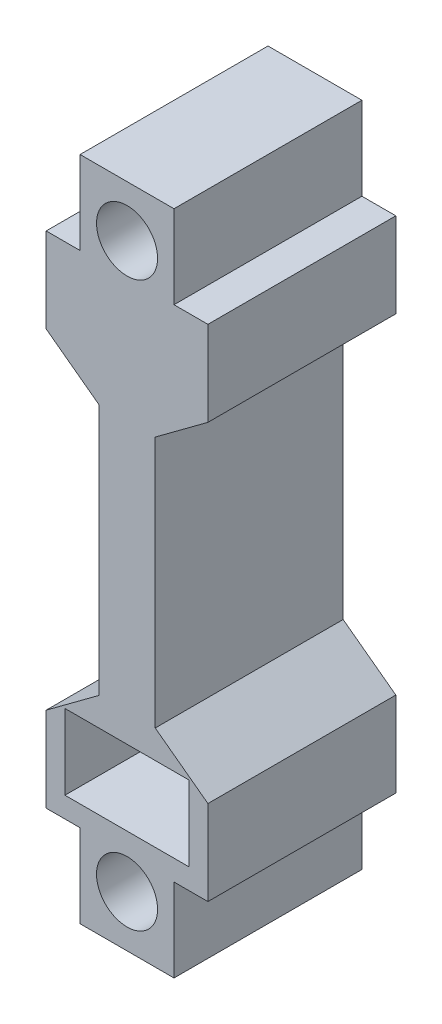
ISO-10303-21;
HEADER;
FILE_DESCRIPTION(('STEP AP214'),'2;1');
FILE_NAME('part.step','',(''),(''),'','','');
FILE_SCHEMA(('AUTOMOTIVE_DESIGN { 1 0 10303 214 1 1 1 1 }'));
ENDSEC;
DATA;
#1=APPLICATION_CONTEXT('core data for automotive mechanical design processes');
#2=APPLICATION_PROTOCOL_DEFINITION('international standard','automotive_design',2000,#1);
#3=PRODUCT_CONTEXT('',#1,'mechanical');
#4=PRODUCT('Part','Part','',(#3));
#5=PRODUCT_RELATED_PRODUCT_CATEGORY('part','',(#4));
#6=PRODUCT_DEFINITION_FORMATION('','',#4);
#7=PRODUCT_DEFINITION_CONTEXT('part definition',#1,'design');
#8=PRODUCT_DEFINITION('design','',#6,#7);
#9=PRODUCT_DEFINITION_SHAPE('','',#8);
#10=(LENGTH_UNIT() NAMED_UNIT(*) SI_UNIT(.MILLI.,.METRE.));
#11=(NAMED_UNIT(*) PLANE_ANGLE_UNIT() SI_UNIT($,.RADIAN.));
#12=(NAMED_UNIT(*) SI_UNIT($,.STERADIAN.) SOLID_ANGLE_UNIT());
#13=UNCERTAINTY_MEASURE_WITH_UNIT(LENGTH_MEASURE(1.E-05),#10,'distance_accuracy_value','');
#14=(GEOMETRIC_REPRESENTATION_CONTEXT(3) GLOBAL_UNCERTAINTY_ASSIGNED_CONTEXT((#13)) GLOBAL_UNIT_ASSIGNED_CONTEXT((#10,
#11,#12)) REPRESENTATION_CONTEXT('',''));
#15=CARTESIAN_POINT('',(0.,0.,0.));
#16=DIRECTION('',(0.,0.,1.));
#17=DIRECTION('',(1.,0.,0.));
#18=AXIS2_PLACEMENT_3D('',#15,#16,#17);
#19=CARTESIAN_POINT('',(0.,0.,20.));
#20=DIRECTION('',(0.,0.,1.));
#21=DIRECTION('',(1.,0.,0.));
#22=AXIS2_PLACEMENT_3D('',#19,#20,#21);
#23=PLANE('',#22);
#24=DIRECTION('',(0.,1.,0.));
#25=VECTOR('',#24,1.);
#26=CARTESIAN_POINT('',(6.60709454060174,-24.4083763532883,20.));
#27=LINE('',#26,#25);
#28=CARTESIAN_POINT('',(6.60709454060174,-24.4083763532883,20.));
#29=VERTEX_POINT('',#28);
#30=CARTESIAN_POINT('',(6.60709454060174,-16.4083763532883,20.));
#31=VERTEX_POINT('',#30);
#32=EDGE_CURVE('E210',#29,#31,#27,.T.);
#33=ORIENTED_EDGE('',*,*,#32,.F.);
#34=DIRECTION('',(1.,0.,0.));
#35=VECTOR('',#34,1.);
#36=CARTESIAN_POINT('',(6.60709454060174,-24.4083763532883,20.));
#37=LINE('',#36,#35);
#38=CARTESIAN_POINT('',(-6.60709454060174,-24.4083763532883,20.));
#39=VERTEX_POINT('',#38);
#40=EDGE_CURVE('E201',#39,#29,#37,.T.);
#41=ORIENTED_EDGE('',*,*,#40,.F.);
#42=DIRECTION('',(0.,-1.,0.));
#43=VECTOR('',#42,1.);
#44=CARTESIAN_POINT('',(-6.60709454060174,-24.4083763532883,20.));
#45=LINE('',#44,#43);
#46=CARTESIAN_POINT('',(-6.60709454060174,-16.4083763532883,20.));
#47=VERTEX_POINT('',#46);
#48=EDGE_CURVE('E228',#47,#39,#45,.T.);
#49=ORIENTED_EDGE('',*,*,#48,.F.);
#50=DIRECTION('',(-1.,0.,0.));
#51=VECTOR('',#50,1.);
#52=CARTESIAN_POINT('',(-6.60709454060174,-16.4083763532883,20.));
#53=LINE('',#52,#51);
#54=EDGE_CURVE('E224',#31,#47,#53,.T.);
#55=ORIENTED_EDGE('',*,*,#54,.F.);
#56=EDGE_LOOP('',(#33,#41,#49,#55));
#57=FACE_BOUND('',#56,.T.);
#58=CARTESIAN_POINT('',(0.,30.,20.));
#59=DIRECTION('',(0.,0.,1.));
#60=DIRECTION('',(1.,0.,0.));
#61=AXIS2_PLACEMENT_3D('',#58,#59,#60);
#62=CIRCLE('',#61,3.25);
#63=CARTESIAN_POINT('',(3.25,30.,20.));
#64=VERTEX_POINT('',#63);
#65=EDGE_CURVE('E252',#64,#64,#62,.T.);
#66=ORIENTED_EDGE('',*,*,#65,.F.);
#67=EDGE_LOOP('',(#66));
#68=FACE_BOUND('',#67,.T.);
#69=DIRECTION('',(0.803198893234773,-0.595710951642183,0.));
#70=VECTOR('',#69,1.);
#71=CARTESIAN_POINT('',(-8.60709454060174,17.5670071144406,20.));
#72=LINE('',#71,#70);
#73=CARTESIAN_POINT('',(-8.60709454060174,17.5670071144406,20.));
#74=VERTEX_POINT('',#73);
#75=CARTESIAN_POINT('',(-3.,13.4083763532883,20.));
#76=VERTEX_POINT('',#75);
#77=EDGE_CURVE('E260',#74,#76,#72,.T.);
#78=ORIENTED_EDGE('',*,*,#77,.T.);
#79=DIRECTION('',(0.,-1.,0.));
#80=VECTOR('',#79,1.);
#81=CARTESIAN_POINT('',(-3.,13.4083763532883,20.));
#82=LINE('',#81,#80);
#83=CARTESIAN_POINT('',(-2.99999999999999,-13.4083763532883,20.));
#84=VERTEX_POINT('',#83);
#85=EDGE_CURVE('E264',#76,#84,#82,.T.);
#86=ORIENTED_EDGE('',*,*,#85,.T.);
#87=DIRECTION('',(-0.803198893234772,-0.595710951642184,0.));
#88=VECTOR('',#87,1.);
#89=CARTESIAN_POINT('',(-8.60709454060174,-17.5670071144406,20.));
#90=LINE('',#89,#88);
#91=CARTESIAN_POINT('',(-8.60709454060174,-17.5670071144406,20.));
#92=VERTEX_POINT('',#91);
#93=EDGE_CURVE('E268',#84,#92,#90,.T.);
#94=ORIENTED_EDGE('',*,*,#93,.T.);
#95=DIRECTION('',(0.,-1.,0.));
#96=VECTOR('',#95,1.);
#97=CARTESIAN_POINT('',(-8.60709454060173,-26.6027849304811,20.));
#98=LINE('',#97,#96);
#99=CARTESIAN_POINT('',(-8.60709454060173,-26.6027849304811,20.));
#100=VERTEX_POINT('',#99);
#101=EDGE_CURVE('E271',#92,#100,#98,.T.);
#102=ORIENTED_EDGE('',*,*,#101,.T.);
#103=DIRECTION('',(1.,0.,0.));
#104=VECTOR('',#103,1.);
#105=CARTESIAN_POINT('',(-8.60709454060173,-26.6027849304811,20.));
#106=LINE('',#105,#104);
#107=CARTESIAN_POINT('',(-4.9980986518052,-26.6027849304811,20.));
#108=VERTEX_POINT('',#107);
#109=EDGE_CURVE('E274',#100,#108,#106,.T.);
#110=ORIENTED_EDGE('',*,*,#109,.T.);
#111=DIRECTION('',(0.,-1.,0.));
#112=VECTOR('',#111,1.);
#113=CARTESIAN_POINT('',(-4.9980986518052,-26.6027849304811,20.));
#114=LINE('',#113,#112);
#115=CARTESIAN_POINT('',(-4.9980986518052,-35.4520375162647,20.));
#116=VERTEX_POINT('',#115);
#117=EDGE_CURVE('E277',#108,#116,#114,.T.);
#118=ORIENTED_EDGE('',*,*,#117,.T.);
#119=DIRECTION('',(1.,0.,0.));
#120=VECTOR('',#119,1.);
#121=CARTESIAN_POINT('',(-4.9980986518052,-35.4520375162647,20.));
#122=LINE('',#121,#120);
#123=CARTESIAN_POINT('',(4.99809865180521,-35.4520375162647,20.));
#124=VERTEX_POINT('',#123);
#125=EDGE_CURVE('E280',#116,#124,#122,.T.);
#126=ORIENTED_EDGE('',*,*,#125,.T.);
#127=DIRECTION('',(0.,1.,0.));
#128=VECTOR('',#127,1.);
#129=CARTESIAN_POINT('',(4.99809865180522,-26.6027849304811,20.));
#130=LINE('',#129,#128);
#131=CARTESIAN_POINT('',(4.99809865180522,-26.6027849304811,20.));
#132=VERTEX_POINT('',#131);
#133=EDGE_CURVE('E283',#124,#132,#130,.T.);
#134=ORIENTED_EDGE('',*,*,#133,.T.);
#135=DIRECTION('',(1.,0.,0.));
#136=VECTOR('',#135,1.);
#137=CARTESIAN_POINT('',(8.60709454060175,-26.6027849304811,20.));
#138=LINE('',#137,#136);
#139=CARTESIAN_POINT('',(8.60709454060175,-26.6027849304811,20.));
#140=VERTEX_POINT('',#139);
#141=EDGE_CURVE('E286',#132,#140,#138,.T.);
#142=ORIENTED_EDGE('',*,*,#141,.T.);
#143=DIRECTION('',(0.,1.,0.));
#144=VECTOR('',#143,1.);
#145=CARTESIAN_POINT('',(8.60709454060175,-26.6027849304811,20.));
#146=LINE('',#145,#144);
#147=CARTESIAN_POINT('',(8.60709454060175,-17.5670071144406,20.));
#148=VERTEX_POINT('',#147);
#149=EDGE_CURVE('E289',#140,#148,#146,.T.);
#150=ORIENTED_EDGE('',*,*,#149,.T.);
#151=DIRECTION('',(-0.803198893234773,0.595710951642184,0.));
#152=VECTOR('',#151,1.);
#153=CARTESIAN_POINT('',(8.60709454060175,-17.5670071144406,20.));
#154=LINE('',#153,#152);
#155=CARTESIAN_POINT('',(3.00000000000001,-13.4083763532883,20.));
#156=VERTEX_POINT('',#155);
#157=EDGE_CURVE('E292',#148,#156,#154,.T.);
#158=ORIENTED_EDGE('',*,*,#157,.T.);
#159=DIRECTION('',(0.,1.,0.));
#160=VECTOR('',#159,1.);
#161=CARTESIAN_POINT('',(3.00000000000001,13.4083763532883,20.));
#162=LINE('',#161,#160);
#163=CARTESIAN_POINT('',(3.00000000000001,13.4083763532883,20.));
#164=VERTEX_POINT('',#163);
#165=EDGE_CURVE('E295',#156,#164,#162,.T.);
#166=ORIENTED_EDGE('',*,*,#165,.T.);
#167=DIRECTION('',(0.803198893234773,0.595710951642184,0.));
#168=VECTOR('',#167,1.);
#169=CARTESIAN_POINT('',(8.60709454060175,17.5670071144406,20.));
#170=LINE('',#169,#168);
#171=CARTESIAN_POINT('',(8.60709454060175,17.5670071144406,20.));
#172=VERTEX_POINT('',#171);
#173=EDGE_CURVE('E298',#164,#172,#170,.T.);
#174=ORIENTED_EDGE('',*,*,#173,.T.);
#175=DIRECTION('',(0.,1.,0.));
#176=VECTOR('',#175,1.);
#177=CARTESIAN_POINT('',(8.60709454060175,26.6027849304811,20.));
#178=LINE('',#177,#176);
#179=CARTESIAN_POINT('',(8.60709454060175,26.6027849304811,20.));
#180=VERTEX_POINT('',#179);
#181=EDGE_CURVE('E301',#172,#180,#178,.T.);
#182=ORIENTED_EDGE('',*,*,#181,.T.);
#183=DIRECTION('',(-1.,0.,0.));
#184=VECTOR('',#183,1.);
#185=CARTESIAN_POINT('',(8.60709454060175,26.6027849304811,20.));
#186=LINE('',#185,#184);
#187=CARTESIAN_POINT('',(4.99809865180522,26.6027849304811,20.));
#188=VERTEX_POINT('',#187);
#189=EDGE_CURVE('E304',#180,#188,#186,.T.);
#190=ORIENTED_EDGE('',*,*,#189,.T.);
#191=DIRECTION('',(0.,1.,0.));
#192=VECTOR('',#191,1.);
#193=CARTESIAN_POINT('',(4.99809865180522,26.6027849304811,20.));
#194=LINE('',#193,#192);
#195=CARTESIAN_POINT('',(4.99809865180521,35.4520375162647,20.));
#196=VERTEX_POINT('',#195);
#197=EDGE_CURVE('E307',#188,#196,#194,.T.);
#198=ORIENTED_EDGE('',*,*,#197,.T.);
#199=DIRECTION('',(-1.,0.,0.));
#200=VECTOR('',#199,1.);
#201=CARTESIAN_POINT('',(-4.99809865180521,35.4520375162647,20.));
#202=LINE('',#201,#200);
#203=CARTESIAN_POINT('',(-4.99809865180521,35.4520375162647,20.));
#204=VERTEX_POINT('',#203);
#205=EDGE_CURVE('E310',#196,#204,#202,.T.);
#206=ORIENTED_EDGE('',*,*,#205,.T.);
#207=DIRECTION('',(0.,-1.,0.));
#208=VECTOR('',#207,1.);
#209=CARTESIAN_POINT('',(-4.99809865180521,26.6027849304811,20.));
#210=LINE('',#209,#208);
#211=CARTESIAN_POINT('',(-4.99809865180521,26.6027849304811,20.));
#212=VERTEX_POINT('',#211);
#213=EDGE_CURVE('E313',#204,#212,#210,.T.);
#214=ORIENTED_EDGE('',*,*,#213,.T.);
#215=DIRECTION('',(-1.,0.,0.));
#216=VECTOR('',#215,1.);
#217=CARTESIAN_POINT('',(-8.60709454060174,26.6027849304811,20.));
#218=LINE('',#217,#216);
#219=CARTESIAN_POINT('',(-8.60709454060174,26.6027849304811,20.));
#220=VERTEX_POINT('',#219);
#221=EDGE_CURVE('E316',#212,#220,#218,.T.);
#222=ORIENTED_EDGE('',*,*,#221,.T.);
#223=DIRECTION('',(0.,-1.,0.));
#224=VECTOR('',#223,1.);
#225=CARTESIAN_POINT('',(-8.60709454060174,26.6027849304811,20.));
#226=LINE('',#225,#224);
#227=EDGE_CURVE('E319',#220,#74,#226,.T.);
#228=ORIENTED_EDGE('',*,*,#227,.T.);
#229=EDGE_LOOP('',(#78,#86,#94,#102,#110,#118,#126,#134,#142,#150,#158,#166,#174,#182,#190,#198,
#206,#214,#222,#228));
#230=FACE_BOUND('',#229,.T.);
#231=CARTESIAN_POINT('',(0.,-30.,20.));
#232=DIRECTION('',(0.,0.,1.));
#233=DIRECTION('',(-1.,0.,0.));
#234=AXIS2_PLACEMENT_3D('',#231,#232,#233);
#235=CIRCLE('',#234,3.25);
#236=CARTESIAN_POINT('',(-3.25,-30.,20.));
#237=VERTEX_POINT('',#236);
#238=EDGE_CURVE('E236',#237,#237,#235,.T.);
#239=ORIENTED_EDGE('',*,*,#238,.F.);
#240=EDGE_LOOP('',(#239));
#241=FACE_BOUND('',#240,.T.);
#242=ADVANCED_FACE('F39',(#57,#68,#230,#241),#23,.T.);
#243=CARTESIAN_POINT('',(0.,0.,0.));
#244=DIRECTION('',(0.,0.,1.));
#245=DIRECTION('',(1.,0.,0.));
#246=AXIS2_PLACEMENT_3D('',#243,#244,#245);
#247=PLANE('',#246);
#248=CARTESIAN_POINT('',(0.,30.,0.));
#249=DIRECTION('',(0.,0.,1.));
#250=DIRECTION('',(1.,0.,0.));
#251=AXIS2_PLACEMENT_3D('',#248,#249,#250);
#252=CIRCLE('',#251,3.25);
#253=CARTESIAN_POINT('',(3.25,30.,0.));
#254=VERTEX_POINT('',#253);
#255=EDGE_CURVE('E219',#254,#254,#252,.T.);
#256=ORIENTED_EDGE('',*,*,#255,.T.);
#257=EDGE_LOOP('',(#256));
#258=FACE_BOUND('',#257,.T.);
#259=DIRECTION('',(0.803198893234773,-0.595710951642183,0.));
#260=VECTOR('',#259,1.);
#261=CARTESIAN_POINT('',(-8.60709454060174,17.5670071144406,0.));
#262=LINE('',#261,#260);
#263=CARTESIAN_POINT('',(-8.60709454060174,17.5670071144406,0.));
#264=VERTEX_POINT('',#263);
#265=CARTESIAN_POINT('',(-3.,13.4083763532883,0.));
#266=VERTEX_POINT('',#265);
#267=EDGE_CURVE('E256',#264,#266,#262,.T.);
#268=ORIENTED_EDGE('',*,*,#267,.F.);
#269=DIRECTION('',(0.,-1.,0.));
#270=VECTOR('',#269,1.);
#271=CARTESIAN_POINT('',(-8.60709454060174,26.6027849304811,0.));
#272=LINE('',#271,#270);
#273=CARTESIAN_POINT('',(-8.60709454060174,26.6027849304811,0.));
#274=VERTEX_POINT('',#273);
#275=EDGE_CURVE('E265',#274,#264,#272,.T.);
#276=ORIENTED_EDGE('',*,*,#275,.F.);
#277=DIRECTION('',(-1.,0.,0.));
#278=VECTOR('',#277,1.);
#279=CARTESIAN_POINT('',(-8.60709454060174,26.6027849304811,0.));
#280=LINE('',#279,#278);
#281=CARTESIAN_POINT('',(-4.99809865180521,26.6027849304811,0.));
#282=VERTEX_POINT('',#281);
#283=EDGE_CURVE('E377',#282,#274,#280,.T.);
#284=ORIENTED_EDGE('',*,*,#283,.F.);
#285=DIRECTION('',(0.,-1.,0.));
#286=VECTOR('',#285,1.);
#287=CARTESIAN_POINT('',(-4.99809865180521,26.6027849304811,0.));
#288=LINE('',#287,#286);
#289=CARTESIAN_POINT('',(-4.99809865180521,35.4520375162647,0.));
#290=VERTEX_POINT('',#289);
#291=EDGE_CURVE('E374',#290,#282,#288,.T.);
#292=ORIENTED_EDGE('',*,*,#291,.F.);
#293=DIRECTION('',(-1.,0.,0.));
#294=VECTOR('',#293,1.);
#295=CARTESIAN_POINT('',(-4.99809865180521,35.4520375162647,0.));
#296=LINE('',#295,#294);
#297=CARTESIAN_POINT('',(4.99809865180521,35.4520375162647,0.));
#298=VERTEX_POINT('',#297);
#299=EDGE_CURVE('E371',#298,#290,#296,.T.);
#300=ORIENTED_EDGE('',*,*,#299,.F.);
#301=DIRECTION('',(0.,1.,0.));
#302=VECTOR('',#301,1.);
#303=CARTESIAN_POINT('',(4.99809865180522,26.6027849304811,0.));
#304=LINE('',#303,#302);
#305=CARTESIAN_POINT('',(4.99809865180522,26.6027849304811,0.));
#306=VERTEX_POINT('',#305);
#307=EDGE_CURVE('E368',#306,#298,#304,.T.);
#308=ORIENTED_EDGE('',*,*,#307,.F.);
#309=DIRECTION('',(-1.,0.,0.));
#310=VECTOR('',#309,1.);
#311=CARTESIAN_POINT('',(8.60709454060175,26.6027849304811,0.));
#312=LINE('',#311,#310);
#313=CARTESIAN_POINT('',(8.60709454060175,26.6027849304811,0.));
#314=VERTEX_POINT('',#313);
#315=EDGE_CURVE('E365',#314,#306,#312,.T.);
#316=ORIENTED_EDGE('',*,*,#315,.F.);
#317=DIRECTION('',(0.,1.,0.));
#318=VECTOR('',#317,1.);
#319=CARTESIAN_POINT('',(8.60709454060175,26.6027849304811,0.));
#320=LINE('',#319,#318);
#321=CARTESIAN_POINT('',(8.60709454060175,17.5670071144406,0.));
#322=VERTEX_POINT('',#321);
#323=EDGE_CURVE('E362',#322,#314,#320,.T.);
#324=ORIENTED_EDGE('',*,*,#323,.F.);
#325=DIRECTION('',(0.803198893234773,0.595710951642184,0.));
#326=VECTOR('',#325,1.);
#327=CARTESIAN_POINT('',(8.60709454060175,17.5670071144406,0.));
#328=LINE('',#327,#326);
#329=CARTESIAN_POINT('',(3.00000000000001,13.4083763532883,0.));
#330=VERTEX_POINT('',#329);
#331=EDGE_CURVE('E359',#330,#322,#328,.T.);
#332=ORIENTED_EDGE('',*,*,#331,.F.);
#333=DIRECTION('',(0.,1.,0.));
#334=VECTOR('',#333,1.);
#335=CARTESIAN_POINT('',(3.00000000000001,13.4083763532883,0.));
#336=LINE('',#335,#334);
#337=CARTESIAN_POINT('',(3.00000000000001,-13.4083763532883,0.));
#338=VERTEX_POINT('',#337);
#339=EDGE_CURVE('E356',#338,#330,#336,.T.);
#340=ORIENTED_EDGE('',*,*,#339,.F.);
#341=DIRECTION('',(-0.803198893234773,0.595710951642184,0.));
#342=VECTOR('',#341,1.);
#343=CARTESIAN_POINT('',(8.60709454060175,-17.5670071144406,0.));
#344=LINE('',#343,#342);
#345=CARTESIAN_POINT('',(8.60709454060175,-17.5670071144406,0.));
#346=VERTEX_POINT('',#345);
#347=EDGE_CURVE('E353',#346,#338,#344,.T.);
#348=ORIENTED_EDGE('',*,*,#347,.F.);
#349=DIRECTION('',(0.,1.,0.));
#350=VECTOR('',#349,1.);
#351=CARTESIAN_POINT('',(8.60709454060175,-26.6027849304811,0.));
#352=LINE('',#351,#350);
#353=CARTESIAN_POINT('',(8.60709454060175,-26.6027849304811,0.));
#354=VERTEX_POINT('',#353);
#355=EDGE_CURVE('E350',#354,#346,#352,.T.);
#356=ORIENTED_EDGE('',*,*,#355,.F.);
#357=DIRECTION('',(1.,0.,0.));
#358=VECTOR('',#357,1.);
#359=CARTESIAN_POINT('',(8.60709454060175,-26.6027849304811,0.));
#360=LINE('',#359,#358);
#361=CARTESIAN_POINT('',(4.99809865180522,-26.6027849304811,0.));
#362=VERTEX_POINT('',#361);
#363=EDGE_CURVE('E347',#362,#354,#360,.T.);
#364=ORIENTED_EDGE('',*,*,#363,.F.);
#365=DIRECTION('',(0.,1.,0.));
#366=VECTOR('',#365,1.);
#367=CARTESIAN_POINT('',(4.99809865180522,-26.6027849304811,0.));
#368=LINE('',#367,#366);
#369=CARTESIAN_POINT('',(4.99809865180521,-35.4520375162647,0.));
#370=VERTEX_POINT('',#369);
#371=EDGE_CURVE('E344',#370,#362,#368,.T.);
#372=ORIENTED_EDGE('',*,*,#371,.F.);
#373=DIRECTION('',(1.,0.,0.));
#374=VECTOR('',#373,1.);
#375=CARTESIAN_POINT('',(-4.9980986518052,-35.4520375162647,0.));
#376=LINE('',#375,#374);
#377=CARTESIAN_POINT('',(-4.9980986518052,-35.4520375162647,0.));
#378=VERTEX_POINT('',#377);
#379=EDGE_CURVE('E341',#378,#370,#376,.T.);
#380=ORIENTED_EDGE('',*,*,#379,.F.);
#381=DIRECTION('',(0.,-1.,0.));
#382=VECTOR('',#381,1.);
#383=CARTESIAN_POINT('',(-4.9980986518052,-26.6027849304811,0.));
#384=LINE('',#383,#382);
#385=CARTESIAN_POINT('',(-4.9980986518052,-26.6027849304811,0.));
#386=VERTEX_POINT('',#385);
#387=EDGE_CURVE('E338',#386,#378,#384,.T.);
#388=ORIENTED_EDGE('',*,*,#387,.F.);
#389=DIRECTION('',(1.,0.,0.));
#390=VECTOR('',#389,1.);
#391=CARTESIAN_POINT('',(-8.60709454060173,-26.6027849304811,0.));
#392=LINE('',#391,#390);
#393=CARTESIAN_POINT('',(-8.60709454060173,-26.6027849304811,0.));
#394=VERTEX_POINT('',#393);
#395=EDGE_CURVE('E335',#394,#386,#392,.T.);
#396=ORIENTED_EDGE('',*,*,#395,.F.);
#397=DIRECTION('',(0.,-1.,0.));
#398=VECTOR('',#397,1.);
#399=CARTESIAN_POINT('',(-8.60709454060173,-26.6027849304811,0.));
#400=LINE('',#399,#398);
#401=CARTESIAN_POINT('',(-8.60709454060174,-17.5670071144406,0.));
#402=VERTEX_POINT('',#401);
#403=EDGE_CURVE('E332',#402,#394,#400,.T.);
#404=ORIENTED_EDGE('',*,*,#403,.F.);
#405=DIRECTION('',(-0.803198893234772,-0.595710951642184,0.));
#406=VECTOR('',#405,1.);
#407=CARTESIAN_POINT('',(-8.60709454060174,-17.5670071144406,0.));
#408=LINE('',#407,#406);
#409=CARTESIAN_POINT('',(-2.99999999999999,-13.4083763532883,0.));
#410=VERTEX_POINT('',#409);
#411=EDGE_CURVE('E329',#410,#402,#408,.T.);
#412=ORIENTED_EDGE('',*,*,#411,.F.);
#413=DIRECTION('',(0.,-1.,0.));
#414=VECTOR('',#413,1.);
#415=CARTESIAN_POINT('',(-3.,13.4083763532883,0.));
#416=LINE('',#415,#414);
#417=EDGE_CURVE('E326',#266,#410,#416,.T.);
#418=ORIENTED_EDGE('',*,*,#417,.F.);
#419=EDGE_LOOP('',(#268,#276,#284,#292,#300,#308,#316,#324,#332,#340,#348,#356,#364,#372,#380,
#388,#396,#404,#412,#418));
#420=FACE_BOUND('',#419,.T.);
#421=DIRECTION('',(1.,0.,0.));
#422=VECTOR('',#421,1.);
#423=CARTESIAN_POINT('',(6.60709454060174,-24.4083763532883,0.));
#424=LINE('',#423,#422);
#425=CARTESIAN_POINT('',(-6.60709454060174,-24.4083763532883,0.));
#426=VERTEX_POINT('',#425);
#427=CARTESIAN_POINT('',(6.60709454060174,-24.4083763532883,0.));
#428=VERTEX_POINT('',#427);
#429=EDGE_CURVE('E63',#426,#428,#424,.T.);
#430=ORIENTED_EDGE('',*,*,#429,.T.);
#431=DIRECTION('',(0.,1.,0.));
#432=VECTOR('',#431,1.);
#433=CARTESIAN_POINT('',(6.60709454060174,-24.4083763532883,0.));
#434=LINE('',#433,#432);
#435=CARTESIAN_POINT('',(6.60709454060174,-16.4083763532883,0.));
#436=VERTEX_POINT('',#435);
#437=EDGE_CURVE('E217',#428,#436,#434,.T.);
#438=ORIENTED_EDGE('',*,*,#437,.T.);
#439=DIRECTION('',(-1.,0.,0.));
#440=VECTOR('',#439,1.);
#441=CARTESIAN_POINT('',(-6.60709454060174,-16.4083763532883,0.));
#442=LINE('',#441,#440);
#443=CARTESIAN_POINT('',(-6.60709454060174,-16.4083763532883,0.));
#444=VERTEX_POINT('',#443);
#445=EDGE_CURVE('E239',#436,#444,#442,.T.);
#446=ORIENTED_EDGE('',*,*,#445,.T.);
#447=DIRECTION('',(0.,-1.,0.));
#448=VECTOR('',#447,1.);
#449=CARTESIAN_POINT('',(-6.60709454060174,-24.4083763532883,0.));
#450=LINE('',#449,#448);
#451=EDGE_CURVE('E211',#444,#426,#450,.T.);
#452=ORIENTED_EDGE('',*,*,#451,.T.);
#453=EDGE_LOOP('',(#430,#438,#446,#452));
#454=FACE_BOUND('',#453,.T.);
#455=CARTESIAN_POINT('',(0.,-30.,0.));
#456=DIRECTION('',(0.,0.,1.));
#457=DIRECTION('',(-1.,0.,0.));
#458=AXIS2_PLACEMENT_3D('',#455,#456,#457);
#459=CIRCLE('',#458,3.25);
#460=CARTESIAN_POINT('',(-3.25,-30.,0.));
#461=VERTEX_POINT('',#460);
#462=EDGE_CURVE('E791',#461,#461,#459,.T.);
#463=ORIENTED_EDGE('',*,*,#462,.T.);
#464=EDGE_LOOP('',(#463));
#465=FACE_BOUND('',#464,.T.);
#466=ADVANCED_FACE('F464',(#258,#420,#454,#465),#247,.F.);
#467=CARTESIAN_POINT('',(-8.60709454060174,17.5670071144406,20.));
#468=DIRECTION('',(0.595710951642184,0.803198893234773,0.));
#469=DIRECTION('',(-0.803198893234773,0.595710951642184,0.));
#470=AXIS2_PLACEMENT_3D('',#467,#468,#469);
#471=PLANE('',#470);
#472=ORIENTED_EDGE('',*,*,#267,.T.);
#473=DIRECTION('',(0.,0.,-1.));
#474=VECTOR('',#473,1.);
#475=CARTESIAN_POINT('',(-3.,13.4083763532883,20.));
#476=LINE('',#475,#474);
#477=EDGE_CURVE('E11',#76,#266,#476,.T.);
#478=ORIENTED_EDGE('',*,*,#477,.F.);
#479=ORIENTED_EDGE('',*,*,#77,.F.);
#480=DIRECTION('',(0.,0.,-1.));
#481=VECTOR('',#480,1.);
#482=CARTESIAN_POINT('',(-8.60709454060174,17.5670071144406,20.));
#483=LINE('',#482,#481);
#484=EDGE_CURVE('E322',#74,#264,#483,.T.);
#485=ORIENTED_EDGE('',*,*,#484,.T.);
#486=EDGE_LOOP('',(#472,#478,#479,#485));
#487=FACE_BOUND('',#486,.T.);
#488=ADVANCED_FACE('F41',(#487),#471,.F.);
#489=CARTESIAN_POINT('',(-3.,13.4083763532883,20.));
#490=DIRECTION('',(1.,0.,0.));
#491=DIRECTION('',(0.,1.,0.));
#492=AXIS2_PLACEMENT_3D('',#489,#490,#491);
#493=PLANE('',#492);
#494=ORIENTED_EDGE('',*,*,#417,.T.);
#495=DIRECTION('',(0.,0.,-1.));
#496=VECTOR('',#495,1.);
#497=CARTESIAN_POINT('',(-2.99999999999999,-13.4083763532883,20.));
#498=LINE('',#497,#496);
#499=EDGE_CURVE('E48',#84,#410,#498,.T.);
#500=ORIENTED_EDGE('',*,*,#499,.F.);
#501=ORIENTED_EDGE('',*,*,#85,.F.);
#502=ORIENTED_EDGE('',*,*,#477,.T.);
#503=EDGE_LOOP('',(#494,#500,#501,#502));
#504=FACE_BOUND('',#503,.T.);
#505=ADVANCED_FACE('F482',(#504),#493,.F.);
#506=CARTESIAN_POINT('',(-8.60709454060174,-17.5670071144406,20.));
#507=DIRECTION('',(0.595710951642184,-0.803198893234772,0.));
#508=DIRECTION('',(0.803198893234772,0.595710951642184,0.));
#509=AXIS2_PLACEMENT_3D('',#506,#507,#508);
#510=PLANE('',#509);
#511=ORIENTED_EDGE('',*,*,#411,.T.);
#512=DIRECTION('',(0.,0.,-1.));
#513=VECTOR('',#512,1.);
#514=CARTESIAN_POINT('',(-8.60709454060174,-17.5670071144406,20.));
#515=LINE('',#514,#513);
#516=EDGE_CURVE('E449',#92,#402,#515,.T.);
#517=ORIENTED_EDGE('',*,*,#516,.F.);
#518=ORIENTED_EDGE('',*,*,#93,.F.);
#519=ORIENTED_EDGE('',*,*,#499,.T.);
#520=EDGE_LOOP('',(#511,#517,#518,#519));
#521=FACE_BOUND('',#520,.T.);
#522=ADVANCED_FACE('F458',(#521),#510,.F.);
#523=CARTESIAN_POINT('',(-8.60709454060173,-26.6027849304811,20.));
#524=DIRECTION('',(1.,0.,0.));
#525=DIRECTION('',(0.,1.,0.));
#526=AXIS2_PLACEMENT_3D('',#523,#524,#525);
#527=PLANE('',#526);
#528=ORIENTED_EDGE('',*,*,#403,.T.);
#529=DIRECTION('',(0.,0.,-1.));
#530=VECTOR('',#529,1.);
#531=CARTESIAN_POINT('',(-8.60709454060173,-26.6027849304811,20.));
#532=LINE('',#531,#530);
#533=EDGE_CURVE('E445',#100,#394,#532,.T.);
#534=ORIENTED_EDGE('',*,*,#533,.F.);
#535=ORIENTED_EDGE('',*,*,#101,.F.);
#536=ORIENTED_EDGE('',*,*,#516,.T.);
#537=EDGE_LOOP('',(#528,#534,#535,#536));
#538=FACE_BOUND('',#537,.T.);
#539=ADVANCED_FACE('F470',(#538),#527,.F.);
#540=CARTESIAN_POINT('',(-8.60709454060173,-26.6027849304811,20.));
#541=DIRECTION('',(0.,1.,0.));
#542=DIRECTION('',(0.,0.,1.));
#543=AXIS2_PLACEMENT_3D('',#540,#541,#542);
#544=PLANE('',#543);
#545=ORIENTED_EDGE('',*,*,#395,.T.);
#546=DIRECTION('',(0.,0.,-1.));
#547=VECTOR('',#546,1.);
#548=CARTESIAN_POINT('',(-4.9980986518052,-26.6027849304811,20.));
#549=LINE('',#548,#547);
#550=EDGE_CURVE('E441',#108,#386,#549,.T.);
#551=ORIENTED_EDGE('',*,*,#550,.F.);
#552=ORIENTED_EDGE('',*,*,#109,.F.);
#553=ORIENTED_EDGE('',*,*,#533,.T.);
#554=EDGE_LOOP('',(#545,#551,#552,#553));
#555=FACE_BOUND('',#554,.T.);
#556=ADVANCED_FACE('F474',(#555),#544,.F.);
#557=CARTESIAN_POINT('',(-4.9980986518052,-26.6027849304811,20.));
#558=DIRECTION('',(1.,0.,0.));
#559=DIRECTION('',(0.,1.,0.));
#560=AXIS2_PLACEMENT_3D('',#557,#558,#559);
#561=PLANE('',#560);
#562=ORIENTED_EDGE('',*,*,#387,.T.);
#563=DIRECTION('',(0.,0.,-1.));
#564=VECTOR('',#563,1.);
#565=CARTESIAN_POINT('',(-4.9980986518052,-35.4520375162647,20.));
#566=LINE('',#565,#564);
#567=EDGE_CURVE('E437',#116,#378,#566,.T.);
#568=ORIENTED_EDGE('',*,*,#567,.F.);
#569=ORIENTED_EDGE('',*,*,#117,.F.);
#570=ORIENTED_EDGE('',*,*,#550,.T.);
#571=EDGE_LOOP('',(#562,#568,#569,#570));
#572=FACE_BOUND('',#571,.T.);
#573=ADVANCED_FACE('F555',(#572),#561,.F.);
#574=CARTESIAN_POINT('',(-4.9980986518052,-35.4520375162647,20.));
#575=DIRECTION('',(0.,1.,0.));
#576=DIRECTION('',(0.,0.,1.));
#577=AXIS2_PLACEMENT_3D('',#574,#575,#576);
#578=PLANE('',#577);
#579=ORIENTED_EDGE('',*,*,#379,.T.);
#580=DIRECTION('',(0.,0.,-1.));
#581=VECTOR('',#580,1.);
#582=CARTESIAN_POINT('',(4.99809865180521,-35.4520375162647,20.));
#583=LINE('',#582,#581);
#584=EDGE_CURVE('E433',#124,#370,#583,.T.);
#585=ORIENTED_EDGE('',*,*,#584,.F.);
#586=ORIENTED_EDGE('',*,*,#125,.F.);
#587=ORIENTED_EDGE('',*,*,#567,.T.);
#588=EDGE_LOOP('',(#579,#585,#586,#587));
#589=FACE_BOUND('',#588,.T.);
#590=ADVANCED_FACE('F553',(#589),#578,.F.);
#591=CARTESIAN_POINT('',(4.99809865180522,-26.6027849304811,20.));
#592=DIRECTION('',(-1.,0.,0.));
#593=DIRECTION('',(0.,-1.,0.));
#594=AXIS2_PLACEMENT_3D('',#591,#592,#593);
#595=PLANE('',#594);
#596=ORIENTED_EDGE('',*,*,#371,.T.);
#597=DIRECTION('',(0.,0.,-1.));
#598=VECTOR('',#597,1.);
#599=CARTESIAN_POINT('',(4.99809865180522,-26.6027849304811,20.));
#600=LINE('',#599,#598);
#601=EDGE_CURVE('E429',#132,#362,#600,.T.);
#602=ORIENTED_EDGE('',*,*,#601,.F.);
#603=ORIENTED_EDGE('',*,*,#133,.F.);
#604=ORIENTED_EDGE('',*,*,#584,.T.);
#605=EDGE_LOOP('',(#596,#602,#603,#604));
#606=FACE_BOUND('',#605,.T.);
#607=ADVANCED_FACE('F548',(#606),#595,.F.);
#608=CARTESIAN_POINT('',(8.60709454060175,-26.6027849304811,20.));
#609=DIRECTION('',(0.,1.,0.));
#610=DIRECTION('',(-1.,0.,0.));
#611=AXIS2_PLACEMENT_3D('',#608,#609,#610);
#612=PLANE('',#611);
#613=ORIENTED_EDGE('',*,*,#363,.T.);
#614=DIRECTION('',(0.,0.,-1.));
#615=VECTOR('',#614,1.);
#616=CARTESIAN_POINT('',(8.60709454060175,-26.6027849304811,20.));
#617=LINE('',#616,#615);
#618=EDGE_CURVE('E425',#140,#354,#617,.T.);
#619=ORIENTED_EDGE('',*,*,#618,.F.);
#620=ORIENTED_EDGE('',*,*,#141,.F.);
#621=ORIENTED_EDGE('',*,*,#601,.T.);
#622=EDGE_LOOP('',(#613,#619,#620,#621));
#623=FACE_BOUND('',#622,.T.);
#624=ADVANCED_FACE('F543',(#623),#612,.F.);
#625=CARTESIAN_POINT('',(8.60709454060175,-26.6027849304811,20.));
#626=DIRECTION('',(-1.,0.,0.));
#627=DIRECTION('',(0.,-1.,0.));
#628=AXIS2_PLACEMENT_3D('',#625,#626,#627);
#629=PLANE('',#628);
#630=ORIENTED_EDGE('',*,*,#355,.T.);
#631=DIRECTION('',(0.,0.,-1.));
#632=VECTOR('',#631,1.);
#633=CARTESIAN_POINT('',(8.60709454060175,-17.5670071144406,20.));
#634=LINE('',#633,#632);
#635=EDGE_CURVE('E421',#148,#346,#634,.T.);
#636=ORIENTED_EDGE('',*,*,#635,.F.);
#637=ORIENTED_EDGE('',*,*,#149,.F.);
#638=ORIENTED_EDGE('',*,*,#618,.T.);
#639=EDGE_LOOP('',(#630,#636,#637,#638));
#640=FACE_BOUND('',#639,.T.);
#641=ADVANCED_FACE('F539',(#640),#629,.F.);
#642=CARTESIAN_POINT('',(8.60709454060175,-17.5670071144406,20.));
#643=DIRECTION('',(-0.595710951642184,-0.803198893234773,0.));
#644=DIRECTION('',(0.803198893234773,-0.595710951642184,0.));
#645=AXIS2_PLACEMENT_3D('',#642,#643,#644);
#646=PLANE('',#645);
#647=ORIENTED_EDGE('',*,*,#347,.T.);
#648=DIRECTION('',(0.,0.,-1.));
#649=VECTOR('',#648,1.);
#650=CARTESIAN_POINT('',(3.00000000000001,-13.4083763532883,20.));
#651=LINE('',#650,#649);
#652=EDGE_CURVE('E417',#156,#338,#651,.T.);
#653=ORIENTED_EDGE('',*,*,#652,.F.);
#654=ORIENTED_EDGE('',*,*,#157,.F.);
#655=ORIENTED_EDGE('',*,*,#635,.T.);
#656=EDGE_LOOP('',(#647,#653,#654,#655));
#657=FACE_BOUND('',#656,.T.);
#658=ADVANCED_FACE('F534',(#657),#646,.F.);
#659=CARTESIAN_POINT('',(3.00000000000001,13.4083763532883,20.));
#660=DIRECTION('',(-1.,0.,0.));
#661=DIRECTION('',(0.,0.,1.));
#662=AXIS2_PLACEMENT_3D('',#659,#660,#661);
#663=PLANE('',#662);
#664=ORIENTED_EDGE('',*,*,#339,.T.);
#665=DIRECTION('',(0.,0.,-1.));
#666=VECTOR('',#665,1.);
#667=CARTESIAN_POINT('',(3.00000000000001,13.4083763532883,20.));
#668=LINE('',#667,#666);
#669=EDGE_CURVE('E413',#164,#330,#668,.T.);
#670=ORIENTED_EDGE('',*,*,#669,.F.);
#671=ORIENTED_EDGE('',*,*,#165,.F.);
#672=ORIENTED_EDGE('',*,*,#652,.T.);
#673=EDGE_LOOP('',(#664,#670,#671,#672));
#674=FACE_BOUND('',#673,.T.);
#675=ADVANCED_FACE('F528',(#674),#663,.F.);
#676=CARTESIAN_POINT('',(8.60709454060175,17.5670071144406,20.));
#677=DIRECTION('',(-0.595710951642184,0.803198893234773,0.));
#678=DIRECTION('',(-0.803198893234773,-0.595710951642184,0.));
#679=AXIS2_PLACEMENT_3D('',#676,#677,#678);
#680=PLANE('',#679);
#681=ORIENTED_EDGE('',*,*,#331,.T.);
#682=DIRECTION('',(0.,0.,-1.));
#683=VECTOR('',#682,1.);
#684=CARTESIAN_POINT('',(8.60709454060175,17.5670071144406,20.));
#685=LINE('',#684,#683);
#686=EDGE_CURVE('E409',#172,#322,#685,.T.);
#687=ORIENTED_EDGE('',*,*,#686,.F.);
#688=ORIENTED_EDGE('',*,*,#173,.F.);
#689=ORIENTED_EDGE('',*,*,#669,.T.);
#690=EDGE_LOOP('',(#681,#687,#688,#689));
#691=FACE_BOUND('',#690,.T.);
#692=ADVANCED_FACE('F524',(#691),#680,.F.);
#693=CARTESIAN_POINT('',(8.60709454060175,26.6027849304811,20.));
#694=DIRECTION('',(-1.,0.,0.));
#695=DIRECTION('',(0.,-1.,0.));
#696=AXIS2_PLACEMENT_3D('',#693,#694,#695);
#697=PLANE('',#696);
#698=ORIENTED_EDGE('',*,*,#323,.T.);
#699=DIRECTION('',(0.,0.,-1.));
#700=VECTOR('',#699,1.);
#701=CARTESIAN_POINT('',(8.60709454060175,26.6027849304811,20.));
#702=LINE('',#701,#700);
#703=EDGE_CURVE('E405',#180,#314,#702,.T.);
#704=ORIENTED_EDGE('',*,*,#703,.F.);
#705=ORIENTED_EDGE('',*,*,#181,.F.);
#706=ORIENTED_EDGE('',*,*,#686,.T.);
#707=EDGE_LOOP('',(#698,#704,#705,#706));
#708=FACE_BOUND('',#707,.T.);
#709=ADVANCED_FACE('F519',(#708),#697,.F.);
#710=CARTESIAN_POINT('',(8.60709454060175,26.6027849304811,20.));
#711=DIRECTION('',(0.,-1.,0.));
#712=DIRECTION('',(1.,0.,0.));
#713=AXIS2_PLACEMENT_3D('',#710,#711,#712);
#714=PLANE('',#713);
#715=ORIENTED_EDGE('',*,*,#315,.T.);
#716=DIRECTION('',(0.,0.,-1.));
#717=VECTOR('',#716,1.);
#718=CARTESIAN_POINT('',(4.99809865180522,26.6027849304811,20.));
#719=LINE('',#718,#717);
#720=EDGE_CURVE('E401',#188,#306,#719,.T.);
#721=ORIENTED_EDGE('',*,*,#720,.F.);
#722=ORIENTED_EDGE('',*,*,#189,.F.);
#723=ORIENTED_EDGE('',*,*,#703,.T.);
#724=EDGE_LOOP('',(#715,#721,#722,#723));
#725=FACE_BOUND('',#724,.T.);
#726=ADVANCED_FACE('F513',(#725),#714,.F.);
#727=CARTESIAN_POINT('',(4.99809865180522,26.6027849304811,20.));
#728=DIRECTION('',(-1.,0.,0.));
#729=DIRECTION('',(0.,-1.,0.));
#730=AXIS2_PLACEMENT_3D('',#727,#728,#729);
#731=PLANE('',#730);
#732=ORIENTED_EDGE('',*,*,#307,.T.);
#733=DIRECTION('',(0.,0.,-1.));
#734=VECTOR('',#733,1.);
#735=CARTESIAN_POINT('',(4.99809865180521,35.4520375162647,20.));
#736=LINE('',#735,#734);
#737=EDGE_CURVE('E397',#196,#298,#736,.T.);
#738=ORIENTED_EDGE('',*,*,#737,.F.);
#739=ORIENTED_EDGE('',*,*,#197,.F.);
#740=ORIENTED_EDGE('',*,*,#720,.T.);
#741=EDGE_LOOP('',(#732,#738,#739,#740));
#742=FACE_BOUND('',#741,.T.);
#743=ADVANCED_FACE('F509',(#742),#731,.F.);
#744=CARTESIAN_POINT('',(-4.99809865180521,35.4520375162647,20.));
#745=DIRECTION('',(0.,-1.,0.));
#746=DIRECTION('',(0.,0.,-1.));
#747=AXIS2_PLACEMENT_3D('',#744,#745,#746);
#748=PLANE('',#747);
#749=ORIENTED_EDGE('',*,*,#299,.T.);
#750=DIRECTION('',(0.,0.,-1.));
#751=VECTOR('',#750,1.);
#752=CARTESIAN_POINT('',(-4.99809865180521,35.4520375162647,20.));
#753=LINE('',#752,#751);
#754=EDGE_CURVE('E393',#204,#290,#753,.T.);
#755=ORIENTED_EDGE('',*,*,#754,.F.);
#756=ORIENTED_EDGE('',*,*,#205,.F.);
#757=ORIENTED_EDGE('',*,*,#737,.T.);
#758=EDGE_LOOP('',(#749,#755,#756,#757));
#759=FACE_BOUND('',#758,.T.);
#760=ADVANCED_FACE('F504',(#759),#748,.F.);
#761=CARTESIAN_POINT('',(-4.99809865180521,26.6027849304811,20.));
#762=DIRECTION('',(1.,0.,0.));
#763=DIRECTION('',(0.,0.,-1.));
#764=AXIS2_PLACEMENT_3D('',#761,#762,#763);
#765=PLANE('',#764);
#766=ORIENTED_EDGE('',*,*,#291,.T.);
#767=DIRECTION('',(0.,0.,-1.));
#768=VECTOR('',#767,1.);
#769=CARTESIAN_POINT('',(-4.99809865180521,26.6027849304811,20.));
#770=LINE('',#769,#768);
#771=EDGE_CURVE('E389',#212,#282,#770,.T.);
#772=ORIENTED_EDGE('',*,*,#771,.F.);
#773=ORIENTED_EDGE('',*,*,#213,.F.);
#774=ORIENTED_EDGE('',*,*,#754,.T.);
#775=EDGE_LOOP('',(#766,#772,#773,#774));
#776=FACE_BOUND('',#775,.T.);
#777=ADVANCED_FACE('F498',(#776),#765,.F.);
#778=CARTESIAN_POINT('',(-8.60709454060174,26.6027849304811,20.));
#779=DIRECTION('',(0.,-1.,0.));
#780=DIRECTION('',(1.,0.,0.));
#781=AXIS2_PLACEMENT_3D('',#778,#779,#780);
#782=PLANE('',#781);
#783=ORIENTED_EDGE('',*,*,#283,.T.);
#784=DIRECTION('',(0.,0.,-1.));
#785=VECTOR('',#784,1.);
#786=CARTESIAN_POINT('',(-8.60709454060174,26.6027849304811,20.));
#787=LINE('',#786,#785);
#788=EDGE_CURVE('E385',#220,#274,#787,.T.);
#789=ORIENTED_EDGE('',*,*,#788,.F.);
#790=ORIENTED_EDGE('',*,*,#221,.F.);
#791=ORIENTED_EDGE('',*,*,#771,.T.);
#792=EDGE_LOOP('',(#783,#789,#790,#791));
#793=FACE_BOUND('',#792,.T.);
#794=ADVANCED_FACE('F494',(#793),#782,.F.);
#795=CARTESIAN_POINT('',(-8.60709454060174,26.6027849304811,20.));
#796=DIRECTION('',(1.,0.,0.));
#797=DIRECTION('',(0.,1.,0.));
#798=AXIS2_PLACEMENT_3D('',#795,#796,#797);
#799=PLANE('',#798);
#800=ORIENTED_EDGE('',*,*,#275,.T.);
#801=ORIENTED_EDGE('',*,*,#484,.F.);
#802=ORIENTED_EDGE('',*,*,#227,.F.);
#803=ORIENTED_EDGE('',*,*,#788,.T.);
#804=EDGE_LOOP('',(#800,#801,#802,#803));
#805=FACE_BOUND('',#804,.T.);
#806=ADVANCED_FACE('F489',(#805),#799,.F.);
#807=CARTESIAN_POINT('',(0.,30.,20.));
#808=DIRECTION('',(0.,0.,-1.));
#809=DIRECTION('',(-1.,0.,0.));
#810=AXIS2_PLACEMENT_3D('',#807,#808,#809);
#811=CYLINDRICAL_SURFACE('',#810,3.25);
#812=ORIENTED_EDGE('',*,*,#65,.T.);
#813=EDGE_LOOP('',(#812));
#814=FACE_BOUND('',#813,.T.);
#815=ORIENTED_EDGE('',*,*,#255,.F.);
#816=EDGE_LOOP('',(#815));
#817=FACE_BOUND('',#816,.T.);
#818=ADVANCED_FACE('F572',(#814,#817),#811,.F.);
#819=CARTESIAN_POINT('',(6.60709454060174,-24.4083763532883,20.));
#820=DIRECTION('',(0.,1.,0.));
#821=DIRECTION('',(0.,0.,1.));
#822=AXIS2_PLACEMENT_3D('',#819,#820,#821);
#823=PLANE('',#822);
#824=ORIENTED_EDGE('',*,*,#429,.F.);
#825=DIRECTION('',(0.,0.,-1.));
#826=VECTOR('',#825,1.);
#827=CARTESIAN_POINT('',(-6.60709454060174,-24.4083763532883,20.));
#828=LINE('',#827,#826);
#829=EDGE_CURVE('E205',#39,#426,#828,.T.);
#830=ORIENTED_EDGE('',*,*,#829,.F.);
#831=ORIENTED_EDGE('',*,*,#40,.T.);
#832=DIRECTION('',(0.,0.,-1.));
#833=VECTOR('',#832,1.);
#834=CARTESIAN_POINT('',(6.60709454060174,-24.4083763532883,20.));
#835=LINE('',#834,#833);
#836=EDGE_CURVE('E204',#29,#428,#835,.T.);
#837=ORIENTED_EDGE('',*,*,#836,.T.);
#838=EDGE_LOOP('',(#824,#830,#831,#837));
#839=FACE_BOUND('',#838,.T.);
#840=ADVANCED_FACE('F203',(#839),#823,.T.);
#841=CARTESIAN_POINT('',(6.60709454060174,-24.4083763532883,20.));
#842=DIRECTION('',(-1.,0.,0.));
#843=DIRECTION('',(0.,0.,1.));
#844=AXIS2_PLACEMENT_3D('',#841,#842,#843);
#845=PLANE('',#844);
#846=ORIENTED_EDGE('',*,*,#437,.F.);
#847=ORIENTED_EDGE('',*,*,#836,.F.);
#848=ORIENTED_EDGE('',*,*,#32,.T.);
#849=DIRECTION('',(0.,0.,-1.));
#850=VECTOR('',#849,1.);
#851=CARTESIAN_POINT('',(6.60709454060174,-16.4083763532883,20.));
#852=LINE('',#851,#850);
#853=EDGE_CURVE('E220',#31,#436,#852,.T.);
#854=ORIENTED_EDGE('',*,*,#853,.T.);
#855=EDGE_LOOP('',(#846,#847,#848,#854));
#856=FACE_BOUND('',#855,.T.);
#857=ADVANCED_FACE('F214',(#856),#845,.T.);
#858=CARTESIAN_POINT('',(-6.60709454060174,-16.4083763532883,20.));
#859=DIRECTION('',(0.,-1.,0.));
#860=DIRECTION('',(0.,0.,-1.));
#861=AXIS2_PLACEMENT_3D('',#858,#859,#860);
#862=PLANE('',#861);
#863=ORIENTED_EDGE('',*,*,#445,.F.);
#864=ORIENTED_EDGE('',*,*,#853,.F.);
#865=ORIENTED_EDGE('',*,*,#54,.T.);
#866=DIRECTION('',(0.,0.,-1.));
#867=VECTOR('',#866,1.);
#868=CARTESIAN_POINT('',(-6.60709454060174,-16.4083763532883,20.));
#869=LINE('',#868,#867);
#870=EDGE_CURVE('E55',#47,#444,#869,.T.);
#871=ORIENTED_EDGE('',*,*,#870,.T.);
#872=EDGE_LOOP('',(#863,#864,#865,#871));
#873=FACE_BOUND('',#872,.T.);
#874=ADVANCED_FACE('F669',(#873),#862,.T.);
#875=CARTESIAN_POINT('',(-6.60709454060174,-24.4083763532883,20.));
#876=DIRECTION('',(1.,0.,0.));
#877=DIRECTION('',(0.,0.,-1.));
#878=AXIS2_PLACEMENT_3D('',#875,#876,#877);
#879=PLANE('',#878);
#880=ORIENTED_EDGE('',*,*,#451,.F.);
#881=ORIENTED_EDGE('',*,*,#870,.F.);
#882=ORIENTED_EDGE('',*,*,#48,.T.);
#883=ORIENTED_EDGE('',*,*,#829,.T.);
#884=EDGE_LOOP('',(#880,#881,#882,#883));
#885=FACE_BOUND('',#884,.T.);
#886=ADVANCED_FACE('F676',(#885),#879,.T.);
#887=CARTESIAN_POINT('',(0.,-30.,20.));
#888=DIRECTION('',(0.,0.,-1.));
#889=DIRECTION('',(-1.,0.,0.));
#890=AXIS2_PLACEMENT_3D('',#887,#888,#889);
#891=CYLINDRICAL_SURFACE('',#890,3.25);
#892=ORIENTED_EDGE('',*,*,#238,.T.);
#893=EDGE_LOOP('',(#892));
#894=FACE_BOUND('',#893,.T.);
#895=ORIENTED_EDGE('',*,*,#462,.F.);
#896=EDGE_LOOP('',(#895));
#897=FACE_BOUND('',#896,.T.);
#898=ADVANCED_FACE('F684',(#894,#897),#891,.F.);
#899=CLOSED_SHELL('',(#242,#466,#488,#505,#522,#539,#556,#573,#590,#607,#624,#641,#658,#675,
#692,#709,#726,#743,#760,#777,#794,#806,#818,#840,#857,#874,#886,#898));
#900=MANIFOLD_SOLID_BREP('B2',#899);
#901=ADVANCED_BREP_SHAPE_REPRESENTATION('',(#18,#900),#14);
#902=SHAPE_DEFINITION_REPRESENTATION(#9,#901);
ENDSEC;
END-ISO-10303-21;
